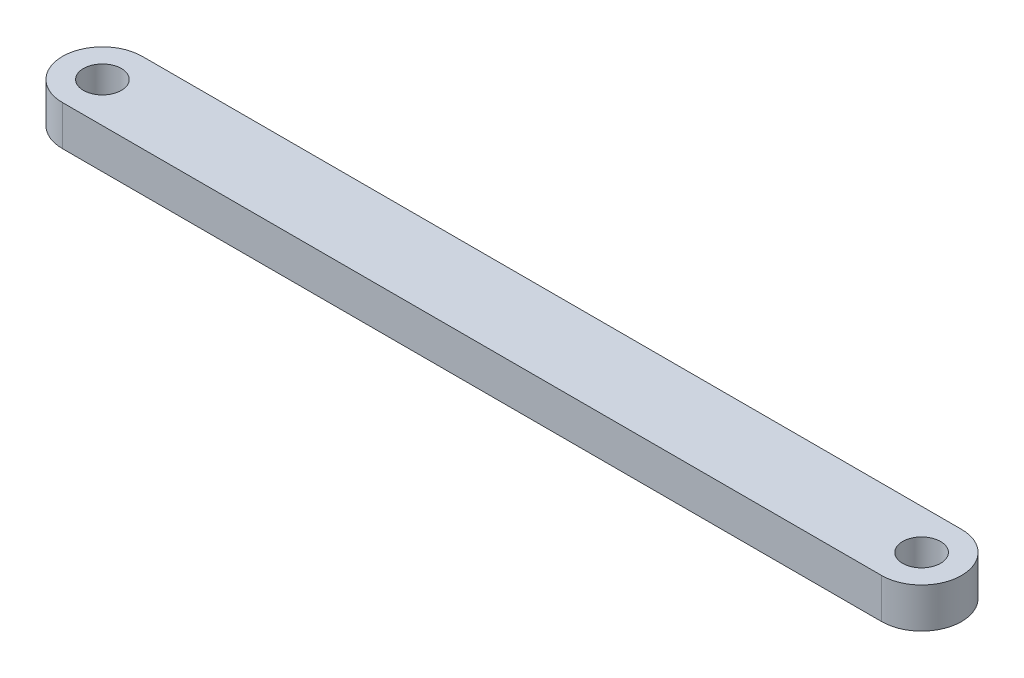
ISO-10303-21;
HEADER;
FILE_DESCRIPTION(('STEP AP214'),'2;1');
FILE_NAME('part.step','',(''),(''),'','','');
FILE_SCHEMA(('AUTOMOTIVE_DESIGN { 1 0 10303 214 1 1 1 1 }'));
ENDSEC;
DATA;
#1=APPLICATION_CONTEXT('core data for automotive mechanical design processes');
#2=APPLICATION_PROTOCOL_DEFINITION('international standard','automotive_design',2000,#1);
#3=PRODUCT_CONTEXT('',#1,'mechanical');
#4=PRODUCT('Part','Part','',(#3));
#5=PRODUCT_RELATED_PRODUCT_CATEGORY('part','',(#4));
#6=PRODUCT_DEFINITION_FORMATION('','',#4);
#7=PRODUCT_DEFINITION_CONTEXT('part definition',#1,'design');
#8=PRODUCT_DEFINITION('design','',#6,#7);
#9=PRODUCT_DEFINITION_SHAPE('','',#8);
#10=(LENGTH_UNIT() NAMED_UNIT(*) SI_UNIT(.MILLI.,.METRE.));
#11=(NAMED_UNIT(*) PLANE_ANGLE_UNIT() SI_UNIT($,.RADIAN.));
#12=(NAMED_UNIT(*) SI_UNIT($,.STERADIAN.) SOLID_ANGLE_UNIT());
#13=UNCERTAINTY_MEASURE_WITH_UNIT(LENGTH_MEASURE(1.E-05),#10,'distance_accuracy_value','');
#14=(GEOMETRIC_REPRESENTATION_CONTEXT(3) GLOBAL_UNCERTAINTY_ASSIGNED_CONTEXT((#13)) GLOBAL_UNIT_ASSIGNED_CONTEXT((#10,
#11,#12)) REPRESENTATION_CONTEXT('',''));
#15=CARTESIAN_POINT('',(0.,0.,0.));
#16=DIRECTION('',(0.,0.,1.));
#17=DIRECTION('',(1.,0.,0.));
#18=AXIS2_PLACEMENT_3D('',#15,#16,#17);
#19=CARTESIAN_POINT('',(102.5,10.,0.));
#20=DIRECTION('',(0.,1.,0.));
#21=DIRECTION('',(0.,0.,1.));
#22=AXIS2_PLACEMENT_3D('',#19,#20,#21);
#23=PLANE('',#22);
#24=CARTESIAN_POINT('',(-102.5,10.,0.));
#25=DIRECTION('',(0.,1.,0.));
#26=DIRECTION('',(0.,0.,1.));
#27=AXIS2_PLACEMENT_3D('',#24,#25,#26);
#28=CIRCLE('',#27,4.75);
#29=CARTESIAN_POINT('',(-102.5,10.,4.75000000000002));
#30=VERTEX_POINT('',#29);
#31=EDGE_CURVE('E100',#30,#30,#28,.T.);
#32=ORIENTED_EDGE('',*,*,#31,.F.);
#33=EDGE_LOOP('',(#32));
#34=FACE_BOUND('',#33,.T.);
#35=CARTESIAN_POINT('',(102.5,10.,0.));
#36=DIRECTION('',(0.,1.,0.));
#37=DIRECTION('',(0.,0.,1.));
#38=AXIS2_PLACEMENT_3D('',#35,#36,#37);
#39=CIRCLE('',#38,10.);
#40=CARTESIAN_POINT('',(102.5,10.,9.99999999999996));
#41=VERTEX_POINT('',#40);
#42=CARTESIAN_POINT('',(102.5,10.,-10.));
#43=VERTEX_POINT('',#42);
#44=EDGE_CURVE('E85',#41,#43,#39,.T.);
#45=ORIENTED_EDGE('',*,*,#44,.T.);
#46=DIRECTION('',(-1.,0.,0.));
#47=VECTOR('',#46,1.);
#48=CARTESIAN_POINT('',(102.5,10.,-10.));
#49=LINE('',#48,#47);
#50=CARTESIAN_POINT('',(-102.5,10.,-9.99999999999999));
#51=VERTEX_POINT('',#50);
#52=EDGE_CURVE('E80',#43,#51,#49,.T.);
#53=ORIENTED_EDGE('',*,*,#52,.T.);
#54=CARTESIAN_POINT('',(-102.5,10.,0.));
#55=DIRECTION('',(0.,1.,0.));
#56=DIRECTION('',(0.,0.,1.));
#57=AXIS2_PLACEMENT_3D('',#54,#55,#56);
#58=CIRCLE('',#57,10.);
#59=CARTESIAN_POINT('',(-102.5,10.,10.));
#60=VERTEX_POINT('',#59);
#61=EDGE_CURVE('E83',#51,#60,#58,.T.);
#62=ORIENTED_EDGE('',*,*,#61,.T.);
#63=DIRECTION('',(1.,0.,0.));
#64=VECTOR('',#63,1.);
#65=CARTESIAN_POINT('',(102.5,10.,9.99999999999996));
#66=LINE('',#65,#64);
#67=EDGE_CURVE('E50',#60,#41,#66,.T.);
#68=ORIENTED_EDGE('',*,*,#67,.T.);
#69=EDGE_LOOP('',(#45,#53,#62,#68));
#70=FACE_BOUND('',#69,.T.);
#71=CARTESIAN_POINT('',(102.5,10.,0.));
#72=DIRECTION('',(0.,1.,0.));
#73=DIRECTION('',(0.,0.,1.));
#74=AXIS2_PLACEMENT_3D('',#71,#72,#73);
#75=CIRCLE('',#74,4.75);
#76=CARTESIAN_POINT('',(102.5,10.,4.74999999999996));
#77=VERTEX_POINT('',#76);
#78=EDGE_CURVE('E115',#77,#77,#75,.T.);
#79=ORIENTED_EDGE('',*,*,#78,.F.);
#80=EDGE_LOOP('',(#79));
#81=FACE_BOUND('',#80,.T.);
#82=ADVANCED_FACE('F33',(#34,#70,#81),#23,.T.);
#83=CARTESIAN_POINT('',(102.5,0.,0.));
#84=DIRECTION('',(0.,1.,0.));
#85=DIRECTION('',(0.,0.,1.));
#86=AXIS2_PLACEMENT_3D('',#83,#84,#85);
#87=PLANE('',#86);
#88=CARTESIAN_POINT('',(102.5,0.,0.));
#89=DIRECTION('',(0.,1.,0.));
#90=DIRECTION('',(0.,0.,1.));
#91=AXIS2_PLACEMENT_3D('',#88,#89,#90);
#92=CIRCLE('',#91,10.);
#93=CARTESIAN_POINT('',(102.5,0.,9.99999999999996));
#94=VERTEX_POINT('',#93);
#95=CARTESIAN_POINT('',(102.5,0.,-10.));
#96=VERTEX_POINT('',#95);
#97=EDGE_CURVE('E97',#94,#96,#92,.T.);
#98=ORIENTED_EDGE('',*,*,#97,.F.);
#99=DIRECTION('',(1.,0.,0.));
#100=VECTOR('',#99,1.);
#101=CARTESIAN_POINT('',(102.5,0.,9.99999999999996));
#102=LINE('',#101,#100);
#103=CARTESIAN_POINT('',(-102.5,0.,10.));
#104=VERTEX_POINT('',#103);
#105=EDGE_CURVE('E73',#104,#94,#102,.T.);
#106=ORIENTED_EDGE('',*,*,#105,.F.);
#107=CARTESIAN_POINT('',(-102.5,0.,0.));
#108=DIRECTION('',(0.,1.,0.));
#109=DIRECTION('',(0.,0.,1.));
#110=AXIS2_PLACEMENT_3D('',#107,#108,#109);
#111=CIRCLE('',#110,10.);
#112=CARTESIAN_POINT('',(-102.5,0.,-9.99999999999999));
#113=VERTEX_POINT('',#112);
#114=EDGE_CURVE('E67',#113,#104,#111,.T.);
#115=ORIENTED_EDGE('',*,*,#114,.F.);
#116=DIRECTION('',(-1.,0.,0.));
#117=VECTOR('',#116,1.);
#118=CARTESIAN_POINT('',(102.5,0.,-10.));
#119=LINE('',#118,#117);
#120=EDGE_CURVE('E89',#96,#113,#119,.T.);
#121=ORIENTED_EDGE('',*,*,#120,.F.);
#122=EDGE_LOOP('',(#98,#106,#115,#121));
#123=FACE_BOUND('',#122,.T.);
#124=CARTESIAN_POINT('',(-102.5,0.,0.));
#125=DIRECTION('',(0.,1.,0.));
#126=DIRECTION('',(0.,0.,1.));
#127=AXIS2_PLACEMENT_3D('',#124,#125,#126);
#128=CIRCLE('',#127,4.75);
#129=CARTESIAN_POINT('',(-102.5,0.,4.75000000000002));
#130=VERTEX_POINT('',#129);
#131=EDGE_CURVE('E112',#130,#130,#128,.T.);
#132=ORIENTED_EDGE('',*,*,#131,.T.);
#133=EDGE_LOOP('',(#132));
#134=FACE_BOUND('',#133,.T.);
#135=CARTESIAN_POINT('',(102.5,0.,0.));
#136=DIRECTION('',(0.,1.,0.));
#137=DIRECTION('',(0.,0.,1.));
#138=AXIS2_PLACEMENT_3D('',#135,#136,#137);
#139=CIRCLE('',#138,4.75);
#140=CARTESIAN_POINT('',(102.5,0.,4.74999999999996));
#141=VERTEX_POINT('',#140);
#142=EDGE_CURVE('E118',#141,#141,#139,.T.);
#143=ORIENTED_EDGE('',*,*,#142,.T.);
#144=EDGE_LOOP('',(#143));
#145=FACE_BOUND('',#144,.T.);
#146=ADVANCED_FACE('F108',(#123,#134,#145),#87,.F.);
#147=CARTESIAN_POINT('',(102.5,10.,0.));
#148=DIRECTION('',(0.,-1.,0.));
#149=DIRECTION('',(0.,0.,-1.));
#150=AXIS2_PLACEMENT_3D('',#147,#148,#149);
#151=CYLINDRICAL_SURFACE('',#150,10.);
#152=ORIENTED_EDGE('',*,*,#97,.T.);
#153=DIRECTION('',(0.,-1.,0.));
#154=VECTOR('',#153,1.);
#155=CARTESIAN_POINT('',(102.5,10.,-10.));
#156=LINE('',#155,#154);
#157=EDGE_CURVE('E11',#43,#96,#156,.T.);
#158=ORIENTED_EDGE('',*,*,#157,.F.);
#159=ORIENTED_EDGE('',*,*,#44,.F.);
#160=DIRECTION('',(0.,-1.,0.));
#161=VECTOR('',#160,1.);
#162=CARTESIAN_POINT('',(102.5,10.,9.99999999999996));
#163=LINE('',#162,#161);
#164=EDGE_CURVE('E93',#41,#94,#163,.T.);
#165=ORIENTED_EDGE('',*,*,#164,.T.);
#166=EDGE_LOOP('',(#152,#158,#159,#165));
#167=FACE_BOUND('',#166,.T.);
#168=ADVANCED_FACE('F35',(#167),#151,.T.);
#169=CARTESIAN_POINT('',(102.5,10.,-10.));
#170=DIRECTION('',(0.,0.,1.));
#171=DIRECTION('',(1.,0.,0.));
#172=AXIS2_PLACEMENT_3D('',#169,#170,#171);
#173=PLANE('',#172);
#174=ORIENTED_EDGE('',*,*,#120,.T.);
#175=DIRECTION('',(0.,-1.,0.));
#176=VECTOR('',#175,1.);
#177=CARTESIAN_POINT('',(-102.5,10.,-9.99999999999999));
#178=LINE('',#177,#176);
#179=EDGE_CURVE('E42',#51,#113,#178,.T.);
#180=ORIENTED_EDGE('',*,*,#179,.F.);
#181=ORIENTED_EDGE('',*,*,#52,.F.);
#182=ORIENTED_EDGE('',*,*,#157,.T.);
#183=EDGE_LOOP('',(#174,#180,#181,#182));
#184=FACE_BOUND('',#183,.T.);
#185=ADVANCED_FACE('F88',(#184),#173,.F.);
#186=CARTESIAN_POINT('',(-102.5,10.,0.));
#187=DIRECTION('',(0.,-1.,0.));
#188=DIRECTION('',(0.,0.,-1.));
#189=AXIS2_PLACEMENT_3D('',#186,#187,#188);
#190=CYLINDRICAL_SURFACE('',#189,10.);
#191=ORIENTED_EDGE('',*,*,#114,.T.);
#192=DIRECTION('',(0.,-1.,0.));
#193=VECTOR('',#192,1.);
#194=CARTESIAN_POINT('',(-102.5,10.,10.));
#195=LINE('',#194,#193);
#196=EDGE_CURVE('E90',#60,#104,#195,.T.);
#197=ORIENTED_EDGE('',*,*,#196,.F.);
#198=ORIENTED_EDGE('',*,*,#61,.F.);
#199=ORIENTED_EDGE('',*,*,#179,.T.);
#200=EDGE_LOOP('',(#191,#197,#198,#199));
#201=FACE_BOUND('',#200,.T.);
#202=ADVANCED_FACE('F91',(#201),#190,.T.);
#203=CARTESIAN_POINT('',(102.5,10.,9.99999999999996));
#204=DIRECTION('',(0.,0.,-1.));
#205=DIRECTION('',(-1.,0.,0.));
#206=AXIS2_PLACEMENT_3D('',#203,#204,#205);
#207=PLANE('',#206);
#208=ORIENTED_EDGE('',*,*,#105,.T.);
#209=ORIENTED_EDGE('',*,*,#164,.F.);
#210=ORIENTED_EDGE('',*,*,#67,.F.);
#211=ORIENTED_EDGE('',*,*,#196,.T.);
#212=EDGE_LOOP('',(#208,#209,#210,#211));
#213=FACE_BOUND('',#212,.T.);
#214=ADVANCED_FACE('F105',(#213),#207,.F.);
#215=CARTESIAN_POINT('',(-102.5,10.,0.));
#216=DIRECTION('',(0.,-1.,0.));
#217=DIRECTION('',(0.,0.,-1.));
#218=AXIS2_PLACEMENT_3D('',#215,#216,#217);
#219=CYLINDRICAL_SURFACE('',#218,4.75);
#220=ORIENTED_EDGE('',*,*,#31,.T.);
#221=EDGE_LOOP('',(#220));
#222=FACE_BOUND('',#221,.T.);
#223=ORIENTED_EDGE('',*,*,#131,.F.);
#224=EDGE_LOOP('',(#223));
#225=FACE_BOUND('',#224,.T.);
#226=ADVANCED_FACE('F135',(#222,#225),#219,.F.);
#227=CARTESIAN_POINT('',(102.5,10.,0.));
#228=DIRECTION('',(0.,-1.,0.));
#229=DIRECTION('',(0.,0.,-1.));
#230=AXIS2_PLACEMENT_3D('',#227,#228,#229);
#231=CYLINDRICAL_SURFACE('',#230,4.75);
#232=ORIENTED_EDGE('',*,*,#78,.T.);
#233=EDGE_LOOP('',(#232));
#234=FACE_BOUND('',#233,.T.);
#235=ORIENTED_EDGE('',*,*,#142,.F.);
#236=EDGE_LOOP('',(#235));
#237=FACE_BOUND('',#236,.T.);
#238=ADVANCED_FACE('F124',(#234,#237),#231,.F.);
#239=CLOSED_SHELL('',(#82,#146,#168,#185,#202,#214,#226,#238));
#240=MANIFOLD_SOLID_BREP('B2',#239);
#241=ADVANCED_BREP_SHAPE_REPRESENTATION('',(#18,#240),#14);
#242=SHAPE_DEFINITION_REPRESENTATION(#9,#241);
ENDSEC;
END-ISO-10303-21;
